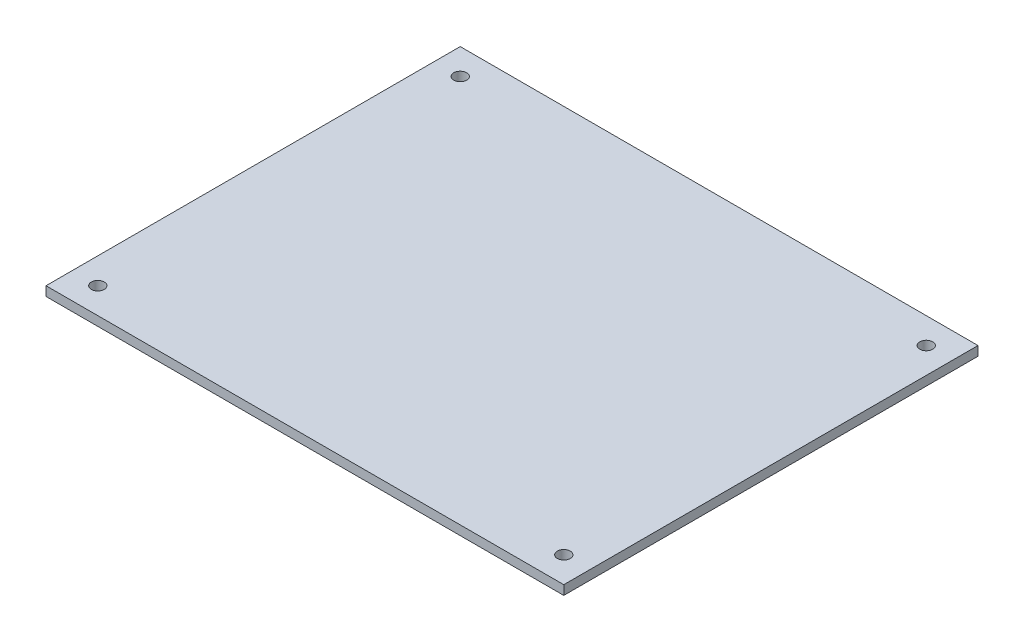
ISO-10303-21;
HEADER;
FILE_DESCRIPTION(('STEP AP214'),'2;1');
FILE_NAME('part.step','',(''),(''),'','','');
FILE_SCHEMA(('AUTOMOTIVE_DESIGN { 1 0 10303 214 1 1 1 1 }'));
ENDSEC;
DATA;
#1=APPLICATION_CONTEXT('core data for automotive mechanical design processes');
#2=APPLICATION_PROTOCOL_DEFINITION('international standard','automotive_design',2000,#1);
#3=PRODUCT_CONTEXT('',#1,'mechanical');
#4=PRODUCT('Part','Part','',(#3));
#5=PRODUCT_RELATED_PRODUCT_CATEGORY('part','',(#4));
#6=PRODUCT_DEFINITION_FORMATION('','',#4);
#7=PRODUCT_DEFINITION_CONTEXT('part definition',#1,'design');
#8=PRODUCT_DEFINITION('design','',#6,#7);
#9=PRODUCT_DEFINITION_SHAPE('','',#8);
#10=(LENGTH_UNIT() NAMED_UNIT(*) SI_UNIT(.MILLI.,.METRE.));
#11=(NAMED_UNIT(*) PLANE_ANGLE_UNIT() SI_UNIT($,.RADIAN.));
#12=(NAMED_UNIT(*) SI_UNIT($,.STERADIAN.) SOLID_ANGLE_UNIT());
#13=UNCERTAINTY_MEASURE_WITH_UNIT(LENGTH_MEASURE(1.E-05),#10,'distance_accuracy_value','');
#14=(GEOMETRIC_REPRESENTATION_CONTEXT(3) GLOBAL_UNCERTAINTY_ASSIGNED_CONTEXT((#13)) GLOBAL_UNIT_ASSIGNED_CONTEXT((#10,
#11,#12)) REPRESENTATION_CONTEXT('',''));
#15=CARTESIAN_POINT('',(0.,0.,0.));
#16=DIRECTION('',(0.,0.,1.));
#17=DIRECTION('',(1.,0.,0.));
#18=AXIS2_PLACEMENT_3D('',#15,#16,#17);
#19=CARTESIAN_POINT('',(50.,1.8,40.));
#20=DIRECTION('',(-1.,0.,0.));
#21=DIRECTION('',(0.,0.,1.));
#22=AXIS2_PLACEMENT_3D('',#19,#20,#21);
#23=PLANE('',#22);
#24=DIRECTION('',(0.,0.,-1.));
#25=VECTOR('',#24,1.);
#26=CARTESIAN_POINT('',(50.,0.,40.));
#27=LINE('',#26,#25);
#28=CARTESIAN_POINT('',(50.,0.,40.));
#29=VERTEX_POINT('',#28);
#30=CARTESIAN_POINT('',(50.,0.,-40.));
#31=VERTEX_POINT('',#30);
#32=EDGE_CURVE('E96',#29,#31,#27,.T.);
#33=ORIENTED_EDGE('',*,*,#32,.T.);
#34=DIRECTION('',(0.,-1.,0.));
#35=VECTOR('',#34,1.);
#36=CARTESIAN_POINT('',(50.,1.8,-40.));
#37=LINE('',#36,#35);
#38=CARTESIAN_POINT('',(50.,1.8,-40.));
#39=VERTEX_POINT('',#38);
#40=EDGE_CURVE('E11',#39,#31,#37,.T.);
#41=ORIENTED_EDGE('',*,*,#40,.F.);
#42=DIRECTION('',(0.,0.,-1.));
#43=VECTOR('',#42,1.);
#44=CARTESIAN_POINT('',(50.,1.8,40.));
#45=LINE('',#44,#43);
#46=CARTESIAN_POINT('',(50.,1.8,40.));
#47=VERTEX_POINT('',#46);
#48=EDGE_CURVE('E84',#47,#39,#45,.T.);
#49=ORIENTED_EDGE('',*,*,#48,.F.);
#50=DIRECTION('',(0.,-1.,0.));
#51=VECTOR('',#50,1.);
#52=CARTESIAN_POINT('',(50.,1.8,40.));
#53=LINE('',#52,#51);
#54=EDGE_CURVE('E92',#47,#29,#53,.T.);
#55=ORIENTED_EDGE('',*,*,#54,.T.);
#56=EDGE_LOOP('',(#33,#41,#49,#55));
#57=FACE_BOUND('',#56,.T.);
#58=ADVANCED_FACE('F33',(#57),#23,.F.);
#59=CARTESIAN_POINT('',(-50.,1.8,-40.));
#60=DIRECTION('',(0.,0.,1.));
#61=DIRECTION('',(1.,0.,0.));
#62=AXIS2_PLACEMENT_3D('',#59,#60,#61);
#63=PLANE('',#62);
#64=DIRECTION('',(-1.,0.,0.));
#65=VECTOR('',#64,1.);
#66=CARTESIAN_POINT('',(-50.,0.,-40.));
#67=LINE('',#66,#65);
#68=CARTESIAN_POINT('',(-50.,0.,-40.));
#69=VERTEX_POINT('',#68);
#70=EDGE_CURVE('E88',#31,#69,#67,.T.);
#71=ORIENTED_EDGE('',*,*,#70,.T.);
#72=DIRECTION('',(0.,-1.,0.));
#73=VECTOR('',#72,1.);
#74=CARTESIAN_POINT('',(-50.,1.8,-40.));
#75=LINE('',#74,#73);
#76=CARTESIAN_POINT('',(-50.,1.8,-40.));
#77=VERTEX_POINT('',#76);
#78=EDGE_CURVE('E41',#77,#69,#75,.T.);
#79=ORIENTED_EDGE('',*,*,#78,.F.);
#80=DIRECTION('',(-1.,0.,0.));
#81=VECTOR('',#80,1.);
#82=CARTESIAN_POINT('',(-50.,1.8,-40.));
#83=LINE('',#82,#81);
#84=EDGE_CURVE('E79',#39,#77,#83,.T.);
#85=ORIENTED_EDGE('',*,*,#84,.F.);
#86=ORIENTED_EDGE('',*,*,#40,.T.);
#87=EDGE_LOOP('',(#71,#79,#85,#86));
#88=FACE_BOUND('',#87,.T.);
#89=ADVANCED_FACE('F87',(#88),#63,.F.);
#90=CARTESIAN_POINT('',(-50.,1.8,40.));
#91=DIRECTION('',(1.,0.,0.));
#92=DIRECTION('',(0.,0.,-1.));
#93=AXIS2_PLACEMENT_3D('',#90,#91,#92);
#94=PLANE('',#93);
#95=DIRECTION('',(0.,0.,1.));
#96=VECTOR('',#95,1.);
#97=CARTESIAN_POINT('',(-50.,0.,40.));
#98=LINE('',#97,#96);
#99=CARTESIAN_POINT('',(-50.,0.,40.));
#100=VERTEX_POINT('',#99);
#101=EDGE_CURVE('E66',#69,#100,#98,.T.);
#102=ORIENTED_EDGE('',*,*,#101,.T.);
#103=DIRECTION('',(0.,-1.,0.));
#104=VECTOR('',#103,1.);
#105=CARTESIAN_POINT('',(-50.,1.8,40.));
#106=LINE('',#105,#104);
#107=CARTESIAN_POINT('',(-50.,1.8,40.));
#108=VERTEX_POINT('',#107);
#109=EDGE_CURVE('E89',#108,#100,#106,.T.);
#110=ORIENTED_EDGE('',*,*,#109,.F.);
#111=DIRECTION('',(0.,0.,1.));
#112=VECTOR('',#111,1.);
#113=CARTESIAN_POINT('',(-50.,1.8,40.));
#114=LINE('',#113,#112);
#115=EDGE_CURVE('E82',#77,#108,#114,.T.);
#116=ORIENTED_EDGE('',*,*,#115,.F.);
#117=ORIENTED_EDGE('',*,*,#78,.T.);
#118=EDGE_LOOP('',(#102,#110,#116,#117));
#119=FACE_BOUND('',#118,.T.);
#120=ADVANCED_FACE('F90',(#119),#94,.F.);
#121=CARTESIAN_POINT('',(-50.,1.8,40.));
#122=DIRECTION('',(0.,0.,-1.));
#123=DIRECTION('',(-1.,0.,0.));
#124=AXIS2_PLACEMENT_3D('',#121,#122,#123);
#125=PLANE('',#124);
#126=DIRECTION('',(1.,0.,0.));
#127=VECTOR('',#126,1.);
#128=CARTESIAN_POINT('',(-50.,0.,40.));
#129=LINE('',#128,#127);
#130=EDGE_CURVE('E72',#100,#29,#129,.T.);
#131=ORIENTED_EDGE('',*,*,#130,.T.);
#132=ORIENTED_EDGE('',*,*,#54,.F.);
#133=DIRECTION('',(1.,0.,0.));
#134=VECTOR('',#133,1.);
#135=CARTESIAN_POINT('',(-50.,1.8,40.));
#136=LINE('',#135,#134);
#137=EDGE_CURVE('E49',#108,#47,#136,.T.);
#138=ORIENTED_EDGE('',*,*,#137,.F.);
#139=ORIENTED_EDGE('',*,*,#109,.T.);
#140=EDGE_LOOP('',(#131,#132,#138,#139));
#141=FACE_BOUND('',#140,.T.);
#142=ADVANCED_FACE('F104',(#141),#125,.F.);
#143=CARTESIAN_POINT('',(0.,1.8,0.));
#144=DIRECTION('',(0.,-1.,0.));
#145=DIRECTION('',(0.,0.,-1.));
#146=AXIS2_PLACEMENT_3D('',#143,#144,#145);
#147=PLANE('',#146);
#148=CARTESIAN_POINT('',(45.,1.8,35.));
#149=DIRECTION('',(0.,1.,0.));
#150=DIRECTION('',(0.,0.,1.));
#151=AXIS2_PLACEMENT_3D('',#148,#149,#150);
#152=CIRCLE('',#151,1.25);
#153=CARTESIAN_POINT('',(45.,1.8,36.25));
#154=VERTEX_POINT('',#153);
#155=EDGE_CURVE('E128',#154,#154,#152,.T.);
#156=ORIENTED_EDGE('',*,*,#155,.F.);
#157=EDGE_LOOP('',(#156));
#158=FACE_BOUND('',#157,.T.);
#159=CARTESIAN_POINT('',(45.,1.8,-35.));
#160=DIRECTION('',(0.,1.,0.));
#161=DIRECTION('',(0.,0.,1.));
#162=AXIS2_PLACEMENT_3D('',#159,#160,#161);
#163=CIRCLE('',#162,1.25);
#164=CARTESIAN_POINT('',(45.,1.8,-33.75));
#165=VERTEX_POINT('',#164);
#166=EDGE_CURVE('E122',#165,#165,#163,.T.);
#167=ORIENTED_EDGE('',*,*,#166,.F.);
#168=EDGE_LOOP('',(#167));
#169=FACE_BOUND('',#168,.T.);
#170=CARTESIAN_POINT('',(-45.,1.8,-35.));
#171=DIRECTION('',(0.,1.,0.));
#172=DIRECTION('',(0.,0.,1.));
#173=AXIS2_PLACEMENT_3D('',#170,#171,#172);
#174=CIRCLE('',#173,1.25);
#175=CARTESIAN_POINT('',(-45.,1.8,-33.75));
#176=VERTEX_POINT('',#175);
#177=EDGE_CURVE('E116',#176,#176,#174,.T.);
#178=ORIENTED_EDGE('',*,*,#177,.F.);
#179=EDGE_LOOP('',(#178));
#180=FACE_BOUND('',#179,.T.);
#181=CARTESIAN_POINT('',(-45.,1.8,35.));
#182=DIRECTION('',(0.,1.,0.));
#183=DIRECTION('',(0.,0.,1.));
#184=AXIS2_PLACEMENT_3D('',#181,#182,#183);
#185=CIRCLE('',#184,1.25);
#186=CARTESIAN_POINT('',(-45.,1.8,36.25));
#187=VERTEX_POINT('',#186);
#188=EDGE_CURVE('E110',#187,#187,#185,.T.);
#189=ORIENTED_EDGE('',*,*,#188,.F.);
#190=EDGE_LOOP('',(#189));
#191=FACE_BOUND('',#190,.T.);
#192=ORIENTED_EDGE('',*,*,#48,.T.);
#193=ORIENTED_EDGE('',*,*,#84,.T.);
#194=ORIENTED_EDGE('',*,*,#115,.T.);
#195=ORIENTED_EDGE('',*,*,#137,.T.);
#196=EDGE_LOOP('',(#192,#193,#194,#195));
#197=FACE_BOUND('',#196,.T.);
#198=ADVANCED_FACE('F80',(#158,#169,#180,#191,#197),#147,.F.);
#199=CARTESIAN_POINT('',(0.,0.,0.));
#200=DIRECTION('',(0.,-1.,0.));
#201=DIRECTION('',(0.,0.,-1.));
#202=AXIS2_PLACEMENT_3D('',#199,#200,#201);
#203=PLANE('',#202);
#204=CARTESIAN_POINT('',(45.,0.,35.));
#205=DIRECTION('',(0.,1.,0.));
#206=DIRECTION('',(0.,0.,1.));
#207=AXIS2_PLACEMENT_3D('',#204,#205,#206);
#208=CIRCLE('',#207,1.25);
#209=CARTESIAN_POINT('',(45.,0.,36.25));
#210=VERTEX_POINT('',#209);
#211=EDGE_CURVE('E125',#210,#210,#208,.T.);
#212=ORIENTED_EDGE('',*,*,#211,.T.);
#213=EDGE_LOOP('',(#212));
#214=FACE_BOUND('',#213,.T.);
#215=CARTESIAN_POINT('',(45.,0.,-35.));
#216=DIRECTION('',(0.,1.,0.));
#217=DIRECTION('',(0.,0.,1.));
#218=AXIS2_PLACEMENT_3D('',#215,#216,#217);
#219=CIRCLE('',#218,1.25);
#220=CARTESIAN_POINT('',(45.,0.,-33.75));
#221=VERTEX_POINT('',#220);
#222=EDGE_CURVE('E119',#221,#221,#219,.T.);
#223=ORIENTED_EDGE('',*,*,#222,.T.);
#224=EDGE_LOOP('',(#223));
#225=FACE_BOUND('',#224,.T.);
#226=CARTESIAN_POINT('',(-45.,0.,-35.));
#227=DIRECTION('',(0.,1.,0.));
#228=DIRECTION('',(0.,0.,1.));
#229=AXIS2_PLACEMENT_3D('',#226,#227,#228);
#230=CIRCLE('',#229,1.25);
#231=CARTESIAN_POINT('',(-45.,0.,-33.75));
#232=VERTEX_POINT('',#231);
#233=EDGE_CURVE('E113',#232,#232,#230,.T.);
#234=ORIENTED_EDGE('',*,*,#233,.T.);
#235=EDGE_LOOP('',(#234));
#236=FACE_BOUND('',#235,.T.);
#237=CARTESIAN_POINT('',(-45.,0.,35.));
#238=DIRECTION('',(0.,1.,0.));
#239=DIRECTION('',(0.,0.,1.));
#240=AXIS2_PLACEMENT_3D('',#237,#238,#239);
#241=CIRCLE('',#240,1.25);
#242=CARTESIAN_POINT('',(-45.,0.,36.25));
#243=VERTEX_POINT('',#242);
#244=EDGE_CURVE('E99',#243,#243,#241,.T.);
#245=ORIENTED_EDGE('',*,*,#244,.T.);
#246=EDGE_LOOP('',(#245));
#247=FACE_BOUND('',#246,.T.);
#248=ORIENTED_EDGE('',*,*,#32,.F.);
#249=ORIENTED_EDGE('',*,*,#130,.F.);
#250=ORIENTED_EDGE('',*,*,#101,.F.);
#251=ORIENTED_EDGE('',*,*,#70,.F.);
#252=EDGE_LOOP('',(#248,#249,#250,#251));
#253=FACE_BOUND('',#252,.T.);
#254=ADVANCED_FACE('F107',(#214,#225,#236,#247,#253),#203,.T.);
#255=CARTESIAN_POINT('',(-45.,0.,35.));
#256=DIRECTION('',(0.,1.,0.));
#257=DIRECTION('',(0.,0.,1.));
#258=AXIS2_PLACEMENT_3D('',#255,#256,#257);
#259=CYLINDRICAL_SURFACE('',#258,1.25);
#260=ORIENTED_EDGE('',*,*,#244,.F.);
#261=EDGE_LOOP('',(#260));
#262=FACE_BOUND('',#261,.T.);
#263=ORIENTED_EDGE('',*,*,#188,.T.);
#264=EDGE_LOOP('',(#263));
#265=FACE_BOUND('',#264,.T.);
#266=ADVANCED_FACE('F152',(#262,#265),#259,.F.);
#267=CARTESIAN_POINT('',(-45.,0.,-35.));
#268=DIRECTION('',(0.,1.,0.));
#269=DIRECTION('',(0.,0.,1.));
#270=AXIS2_PLACEMENT_3D('',#267,#268,#269);
#271=CYLINDRICAL_SURFACE('',#270,1.25);
#272=ORIENTED_EDGE('',*,*,#233,.F.);
#273=EDGE_LOOP('',(#272));
#274=FACE_BOUND('',#273,.T.);
#275=ORIENTED_EDGE('',*,*,#177,.T.);
#276=EDGE_LOOP('',(#275));
#277=FACE_BOUND('',#276,.T.);
#278=ADVANCED_FACE('F154',(#274,#277),#271,.F.);
#279=CARTESIAN_POINT('',(45.,0.,-35.));
#280=DIRECTION('',(0.,1.,0.));
#281=DIRECTION('',(0.,0.,1.));
#282=AXIS2_PLACEMENT_3D('',#279,#280,#281);
#283=CYLINDRICAL_SURFACE('',#282,1.25);
#284=ORIENTED_EDGE('',*,*,#222,.F.);
#285=EDGE_LOOP('',(#284));
#286=FACE_BOUND('',#285,.T.);
#287=ORIENTED_EDGE('',*,*,#166,.T.);
#288=EDGE_LOOP('',(#287));
#289=FACE_BOUND('',#288,.T.);
#290=ADVANCED_FACE('F139',(#286,#289),#283,.F.);
#291=CARTESIAN_POINT('',(45.,0.,35.));
#292=DIRECTION('',(0.,1.,0.));
#293=DIRECTION('',(0.,0.,1.));
#294=AXIS2_PLACEMENT_3D('',#291,#292,#293);
#295=CYLINDRICAL_SURFACE('',#294,1.25);
#296=ORIENTED_EDGE('',*,*,#211,.F.);
#297=EDGE_LOOP('',(#296));
#298=FACE_BOUND('',#297,.T.);
#299=ORIENTED_EDGE('',*,*,#155,.T.);
#300=EDGE_LOOP('',(#299));
#301=FACE_BOUND('',#300,.T.);
#302=ADVANCED_FACE('F136',(#298,#301),#295,.F.);
#303=CLOSED_SHELL('',(#58,#89,#120,#142,#198,#254,#266,#278,#290,#302));
#304=MANIFOLD_SOLID_BREP('B2',#303);
#305=ADVANCED_BREP_SHAPE_REPRESENTATION('',(#18,#304),#14);
#306=SHAPE_DEFINITION_REPRESENTATION(#9,#305);
ENDSEC;
END-ISO-10303-21;
